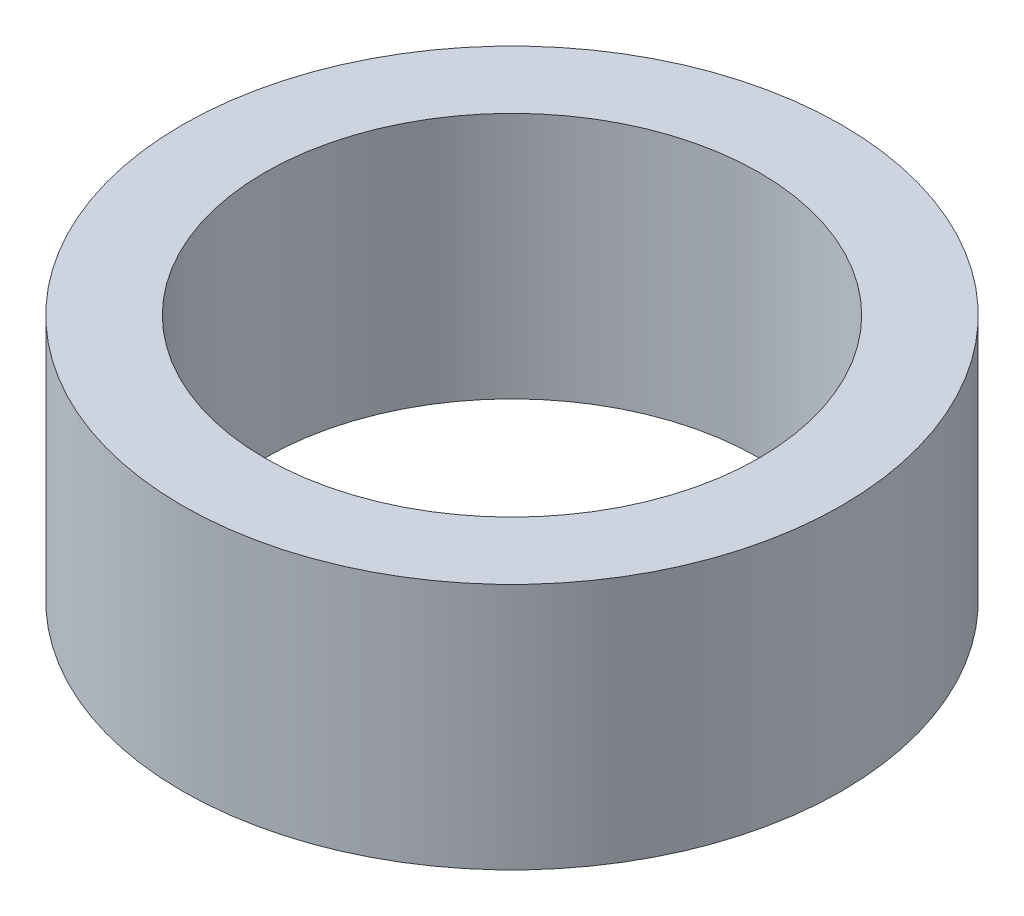
ISO-10303-21;
HEADER;
FILE_DESCRIPTION(('STEP AP214'),'2;1');
FILE_NAME('part.step','',(''),(''),'','','');
FILE_SCHEMA(('AUTOMOTIVE_DESIGN { 1 0 10303 214 1 1 1 1 }'));
ENDSEC;
DATA;
#1=APPLICATION_CONTEXT('core data for automotive mechanical design processes');
#2=APPLICATION_PROTOCOL_DEFINITION('international standard','automotive_design',2000,#1);
#3=PRODUCT_CONTEXT('',#1,'mechanical');
#4=PRODUCT('Part','Part','',(#3));
#5=PRODUCT_RELATED_PRODUCT_CATEGORY('part','',(#4));
#6=PRODUCT_DEFINITION_FORMATION('','',#4);
#7=PRODUCT_DEFINITION_CONTEXT('part definition',#1,'design');
#8=PRODUCT_DEFINITION('design','',#6,#7);
#9=PRODUCT_DEFINITION_SHAPE('','',#8);
#10=(LENGTH_UNIT() NAMED_UNIT(*) SI_UNIT(.MILLI.,.METRE.));
#11=(NAMED_UNIT(*) PLANE_ANGLE_UNIT() SI_UNIT($,.RADIAN.));
#12=(NAMED_UNIT(*) SI_UNIT($,.STERADIAN.) SOLID_ANGLE_UNIT());
#13=UNCERTAINTY_MEASURE_WITH_UNIT(LENGTH_MEASURE(1.E-05),#10,'distance_accuracy_value','');
#14=(GEOMETRIC_REPRESENTATION_CONTEXT(3) GLOBAL_UNCERTAINTY_ASSIGNED_CONTEXT((#13)) GLOBAL_UNIT_ASSIGNED_CONTEXT((#10,
#11,#12)) REPRESENTATION_CONTEXT('',''));
#15=CARTESIAN_POINT('',(0.,0.,0.));
#16=DIRECTION('',(0.,0.,1.));
#17=DIRECTION('',(1.,0.,0.));
#18=AXIS2_PLACEMENT_3D('',#15,#16,#17);
#19=CARTESIAN_POINT('',(0.,6.,0.));
#20=DIRECTION('',(0.,1.,0.));
#21=DIRECTION('',(0.,0.,1.));
#22=AXIS2_PLACEMENT_3D('',#19,#20,#21);
#23=PLANE('',#22);
#24=CARTESIAN_POINT('',(0.,6.,0.));
#25=DIRECTION('',(0.,1.,0.));
#26=DIRECTION('',(0.,0.,1.));
#27=AXIS2_PLACEMENT_3D('',#24,#25,#26);
#28=CIRCLE('',#27,8.);
#29=CARTESIAN_POINT('',(0.,6.,8.));
#30=VERTEX_POINT('',#29);
#31=EDGE_CURVE('E10',#30,#30,#28,.T.);
#32=ORIENTED_EDGE('',*,*,#31,.T.);
#33=EDGE_LOOP('',(#32));
#34=FACE_BOUND('',#33,.T.);
#35=CARTESIAN_POINT('',(0.,6.,0.));
#36=DIRECTION('',(0.,1.,0.));
#37=DIRECTION('',(0.,0.,1.));
#38=AXIS2_PLACEMENT_3D('',#35,#36,#37);
#39=CIRCLE('',#38,6.);
#40=CARTESIAN_POINT('',(0.,6.,6.));
#41=VERTEX_POINT('',#40);
#42=EDGE_CURVE('E44',#41,#41,#39,.T.);
#43=ORIENTED_EDGE('',*,*,#42,.F.);
#44=EDGE_LOOP('',(#43));
#45=FACE_BOUND('',#44,.T.);
#46=ADVANCED_FACE('F33',(#34,#45),#23,.T.);
#47=CARTESIAN_POINT('',(0.,0.,0.));
#48=DIRECTION('',(0.,1.,0.));
#49=DIRECTION('',(0.,0.,1.));
#50=AXIS2_PLACEMENT_3D('',#47,#48,#49);
#51=PLANE('',#50);
#52=CARTESIAN_POINT('',(0.,0.,0.));
#53=DIRECTION('',(0.,1.,0.));
#54=DIRECTION('',(0.,0.,1.));
#55=AXIS2_PLACEMENT_3D('',#52,#53,#54);
#56=CIRCLE('',#55,8.);
#57=CARTESIAN_POINT('',(0.,0.,8.));
#58=VERTEX_POINT('',#57);
#59=EDGE_CURVE('E37',#58,#58,#56,.T.);
#60=ORIENTED_EDGE('',*,*,#59,.F.);
#61=EDGE_LOOP('',(#60));
#62=FACE_BOUND('',#61,.T.);
#63=CARTESIAN_POINT('',(0.,0.,0.));
#64=DIRECTION('',(0.,1.,0.));
#65=DIRECTION('',(0.,0.,1.));
#66=AXIS2_PLACEMENT_3D('',#63,#64,#65);
#67=CIRCLE('',#66,6.);
#68=CARTESIAN_POINT('',(0.,0.,6.));
#69=VERTEX_POINT('',#68);
#70=EDGE_CURVE('E46',#69,#69,#67,.T.);
#71=ORIENTED_EDGE('',*,*,#70,.T.);
#72=EDGE_LOOP('',(#71));
#73=FACE_BOUND('',#72,.T.);
#74=ADVANCED_FACE('F56',(#62,#73),#51,.F.);
#75=CARTESIAN_POINT('',(0.,6.,0.));
#76=DIRECTION('',(0.,-1.,0.));
#77=DIRECTION('',(0.,0.,-1.));
#78=AXIS2_PLACEMENT_3D('',#75,#76,#77);
#79=CYLINDRICAL_SURFACE('',#78,8.);
#80=ORIENTED_EDGE('',*,*,#31,.F.);
#81=EDGE_LOOP('',(#80));
#82=FACE_BOUND('',#81,.T.);
#83=ORIENTED_EDGE('',*,*,#59,.T.);
#84=EDGE_LOOP('',(#83));
#85=FACE_BOUND('',#84,.T.);
#86=ADVANCED_FACE('F35',(#82,#85),#79,.T.);
#87=CARTESIAN_POINT('',(0.,6.,0.));
#88=DIRECTION('',(0.,-1.,0.));
#89=DIRECTION('',(0.,0.,-1.));
#90=AXIS2_PLACEMENT_3D('',#87,#88,#89);
#91=CYLINDRICAL_SURFACE('',#90,6.);
#92=ORIENTED_EDGE('',*,*,#42,.T.);
#93=EDGE_LOOP('',(#92));
#94=FACE_BOUND('',#93,.T.);
#95=ORIENTED_EDGE('',*,*,#70,.F.);
#96=EDGE_LOOP('',(#95));
#97=FACE_BOUND('',#96,.T.);
#98=ADVANCED_FACE('F52',(#94,#97),#91,.F.);
#99=CLOSED_SHELL('',(#46,#74,#86,#98));
#100=MANIFOLD_SOLID_BREP('B2',#99);
#101=ADVANCED_BREP_SHAPE_REPRESENTATION('',(#18,#100),#14);
#102=SHAPE_DEFINITION_REPRESENTATION(#9,#101);
ENDSEC;
END-ISO-10303-21;
